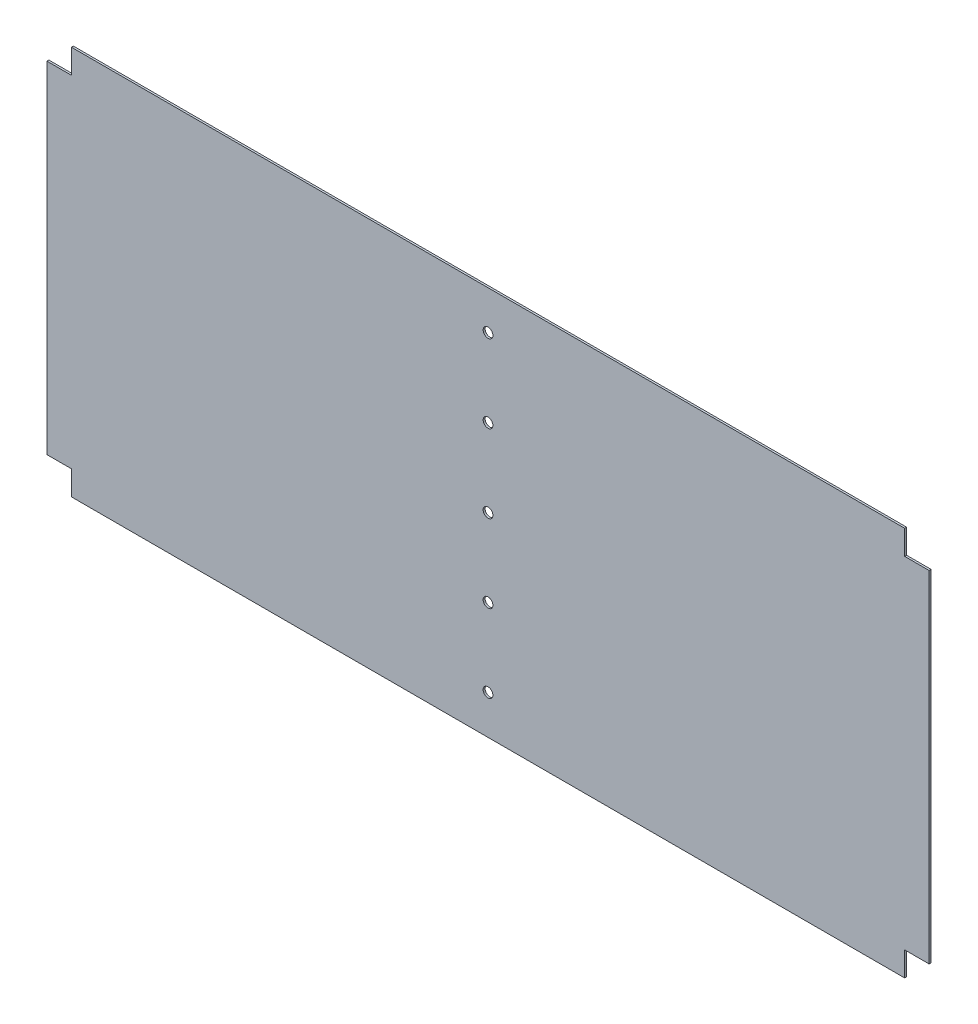
ISO-10303-21;
HEADER;
FILE_DESCRIPTION(('STEP AP214'),'2;1');
FILE_NAME('part.step','',(''),(''),'','','');
FILE_SCHEMA(('AUTOMOTIVE_DESIGN { 1 0 10303 214 1 1 1 1 }'));
ENDSEC;
DATA;
#1=APPLICATION_CONTEXT('core data for automotive mechanical design processes');
#2=APPLICATION_PROTOCOL_DEFINITION('international standard','automotive_design',2000,#1);
#3=PRODUCT_CONTEXT('',#1,'mechanical');
#4=PRODUCT('Part','Part','',(#3));
#5=PRODUCT_RELATED_PRODUCT_CATEGORY('part','',(#4));
#6=PRODUCT_DEFINITION_FORMATION('','',#4);
#7=PRODUCT_DEFINITION_CONTEXT('part definition',#1,'design');
#8=PRODUCT_DEFINITION('design','',#6,#7);
#9=PRODUCT_DEFINITION_SHAPE('','',#8);
#10=(LENGTH_UNIT() NAMED_UNIT(*) SI_UNIT(.MILLI.,.METRE.));
#11=(NAMED_UNIT(*) PLANE_ANGLE_UNIT() SI_UNIT($,.RADIAN.));
#12=(NAMED_UNIT(*) SI_UNIT($,.STERADIAN.) SOLID_ANGLE_UNIT());
#13=UNCERTAINTY_MEASURE_WITH_UNIT(LENGTH_MEASURE(1.E-05),#10,'distance_accuracy_value','');
#14=(GEOMETRIC_REPRESENTATION_CONTEXT(3) GLOBAL_UNCERTAINTY_ASSIGNED_CONTEXT((#13)) GLOBAL_UNIT_ASSIGNED_CONTEXT((#10,
#11,#12)) REPRESENTATION_CONTEXT('',''));
#15=CARTESIAN_POINT('',(0.,0.,0.));
#16=DIRECTION('',(0.,0.,1.));
#17=DIRECTION('',(1.,0.,0.));
#18=AXIS2_PLACEMENT_3D('',#15,#16,#17);
#19=CARTESIAN_POINT('',(-453.,400.,-2.));
#20=DIRECTION('',(-1.,0.,0.));
#21=DIRECTION('',(0.,0.,1.));
#22=AXIS2_PLACEMENT_3D('',#19,#20,#21);
#23=PLANE('',#22);
#24=DIRECTION('',(0.,0.,1.));
#25=VECTOR('',#24,1.);
#26=CARTESIAN_POINT('',(-453.,25.,-10.));
#27=LINE('',#26,#25);
#28=CARTESIAN_POINT('',(-453.,25.,-2.));
#29=VERTEX_POINT('',#28);
#30=CARTESIAN_POINT('',(-453.,25.,0.));
#31=VERTEX_POINT('',#30);
#32=EDGE_CURVE('E158',#29,#31,#27,.T.);
#33=ORIENTED_EDGE('',*,*,#32,.T.);
#34=DIRECTION('',(0.,-1.,0.));
#35=VECTOR('',#34,1.);
#36=CARTESIAN_POINT('',(-453.,400.,0.));
#37=LINE('',#36,#35);
#38=CARTESIAN_POINT('',(-453.,375.,0.));
#39=VERTEX_POINT('',#38);
#40=EDGE_CURVE('E209',#39,#31,#37,.T.);
#41=ORIENTED_EDGE('',*,*,#40,.F.);
#42=DIRECTION('',(0.,0.,1.));
#43=VECTOR('',#42,1.);
#44=CARTESIAN_POINT('',(-453.,375.,-10.));
#45=LINE('',#44,#43);
#46=CARTESIAN_POINT('',(-453.,375.,-2.));
#47=VERTEX_POINT('',#46);
#48=EDGE_CURVE('E181',#47,#39,#45,.T.);
#49=ORIENTED_EDGE('',*,*,#48,.F.);
#50=DIRECTION('',(0.,-1.,0.));
#51=VECTOR('',#50,1.);
#52=CARTESIAN_POINT('',(-453.,400.,-2.));
#53=LINE('',#52,#51);
#54=EDGE_CURVE('E210',#47,#29,#53,.T.);
#55=ORIENTED_EDGE('',*,*,#54,.T.);
#56=EDGE_LOOP('',(#33,#41,#49,#55));
#57=FACE_BOUND('',#56,.T.);
#58=ADVANCED_FACE('F36',(#57),#23,.T.);
#59=CARTESIAN_POINT('',(-453.,400.,-2.));
#60=DIRECTION('',(0.,1.,0.));
#61=DIRECTION('',(-1.,0.,0.));
#62=AXIS2_PLACEMENT_3D('',#59,#60,#61);
#63=PLANE('',#62);
#64=DIRECTION('',(0.,0.,1.));
#65=VECTOR('',#64,1.);
#66=CARTESIAN_POINT('',(428.,400.,-10.));
#67=LINE('',#66,#65);
#68=CARTESIAN_POINT('',(428.,400.,-2.));
#69=VERTEX_POINT('',#68);
#70=CARTESIAN_POINT('',(428.,400.,0.));
#71=VERTEX_POINT('',#70);
#72=EDGE_CURVE('E52',#69,#71,#67,.T.);
#73=ORIENTED_EDGE('',*,*,#72,.F.);
#74=DIRECTION('',(-1.,0.,0.));
#75=VECTOR('',#74,1.);
#76=CARTESIAN_POINT('',(-453.,400.,-2.));
#77=LINE('',#76,#75);
#78=CARTESIAN_POINT('',(-428.,400.,-2.));
#79=VERTEX_POINT('',#78);
#80=EDGE_CURVE('E11',#69,#79,#77,.T.);
#81=ORIENTED_EDGE('',*,*,#80,.T.);
#82=DIRECTION('',(0.,0.,1.));
#83=VECTOR('',#82,1.);
#84=CARTESIAN_POINT('',(-428.,400.,-10.));
#85=LINE('',#84,#83);
#86=CARTESIAN_POINT('',(-428.,400.,0.));
#87=VERTEX_POINT('',#86);
#88=EDGE_CURVE('E182',#79,#87,#85,.T.);
#89=ORIENTED_EDGE('',*,*,#88,.T.);
#90=DIRECTION('',(-1.,0.,0.));
#91=VECTOR('',#90,1.);
#92=CARTESIAN_POINT('',(-453.,400.,0.));
#93=LINE('',#92,#91);
#94=EDGE_CURVE('E39',#71,#87,#93,.T.);
#95=ORIENTED_EDGE('',*,*,#94,.F.);
#96=EDGE_LOOP('',(#73,#81,#89,#95));
#97=FACE_BOUND('',#96,.T.);
#98=ADVANCED_FACE('F225',(#97),#63,.T.);
#99=CARTESIAN_POINT('',(453.,400.,-2.));
#100=DIRECTION('',(1.,0.,0.));
#101=DIRECTION('',(0.,1.,0.));
#102=AXIS2_PLACEMENT_3D('',#99,#100,#101);
#103=PLANE('',#102);
#104=DIRECTION('',(0.,0.,1.));
#105=VECTOR('',#104,1.);
#106=CARTESIAN_POINT('',(453.,25.,-10.));
#107=LINE('',#106,#105);
#108=CARTESIAN_POINT('',(453.,25.,-2.));
#109=VERTEX_POINT('',#108);
#110=CARTESIAN_POINT('',(453.,25.,0.));
#111=VERTEX_POINT('',#110);
#112=EDGE_CURVE('E60',#109,#111,#107,.T.);
#113=ORIENTED_EDGE('',*,*,#112,.F.);
#114=DIRECTION('',(0.,1.,0.));
#115=VECTOR('',#114,1.);
#116=CARTESIAN_POINT('',(453.,400.,-2.));
#117=LINE('',#116,#115);
#118=CARTESIAN_POINT('',(453.,375.,-2.));
#119=VERTEX_POINT('',#118);
#120=EDGE_CURVE('E44',#109,#119,#117,.T.);
#121=ORIENTED_EDGE('',*,*,#120,.T.);
#122=DIRECTION('',(0.,0.,1.));
#123=VECTOR('',#122,1.);
#124=CARTESIAN_POINT('',(453.,375.,-10.));
#125=LINE('',#124,#123);
#126=CARTESIAN_POINT('',(453.,375.,0.));
#127=VERTEX_POINT('',#126);
#128=EDGE_CURVE('E135',#119,#127,#125,.T.);
#129=ORIENTED_EDGE('',*,*,#128,.T.);
#130=DIRECTION('',(0.,1.,0.));
#131=VECTOR('',#130,1.);
#132=CARTESIAN_POINT('',(453.,400.,0.));
#133=LINE('',#132,#131);
#134=EDGE_CURVE('E148',#111,#127,#133,.T.);
#135=ORIENTED_EDGE('',*,*,#134,.F.);
#136=EDGE_LOOP('',(#113,#121,#129,#135));
#137=FACE_BOUND('',#136,.T.);
#138=ADVANCED_FACE('F256',(#137),#103,.T.);
#139=CARTESIAN_POINT('',(-453.,0.,-2.));
#140=DIRECTION('',(0.,-1.,0.));
#141=DIRECTION('',(1.,0.,0.));
#142=AXIS2_PLACEMENT_3D('',#139,#140,#141);
#143=PLANE('',#142);
#144=DIRECTION('',(0.,0.,1.));
#145=VECTOR('',#144,1.);
#146=CARTESIAN_POINT('',(-428.,2.22044604925031E-13,-10.));
#147=LINE('',#146,#145);
#148=CARTESIAN_POINT('',(-428.,2.22044604925031E-13,-2.));
#149=VERTEX_POINT('',#148);
#150=CARTESIAN_POINT('',(-428.,0.,0.));
#151=VERTEX_POINT('',#150);
#152=EDGE_CURVE('E171',#149,#151,#147,.T.);
#153=ORIENTED_EDGE('',*,*,#152,.F.);
#154=DIRECTION('',(1.,0.,0.));
#155=VECTOR('',#154,1.);
#156=CARTESIAN_POINT('',(-453.,0.,-2.));
#157=LINE('',#156,#155);
#158=CARTESIAN_POINT('',(428.,2.22044604925031E-13,-2.));
#159=VERTEX_POINT('',#158);
#160=EDGE_CURVE('E213',#149,#159,#157,.T.);
#161=ORIENTED_EDGE('',*,*,#160,.T.);
#162=DIRECTION('',(0.,0.,1.));
#163=VECTOR('',#162,1.);
#164=CARTESIAN_POINT('',(428.,2.22044604925031E-13,-10.));
#165=LINE('',#164,#163);
#166=CARTESIAN_POINT('',(428.,2.22044604925031E-13,0.));
#167=VERTEX_POINT('',#166);
#168=EDGE_CURVE('E142',#159,#167,#165,.T.);
#169=ORIENTED_EDGE('',*,*,#168,.T.);
#170=DIRECTION('',(1.,0.,0.));
#171=VECTOR('',#170,1.);
#172=CARTESIAN_POINT('',(-453.,0.,0.));
#173=LINE('',#172,#171);
#174=EDGE_CURVE('E220',#151,#167,#173,.T.);
#175=ORIENTED_EDGE('',*,*,#174,.F.);
#176=EDGE_LOOP('',(#153,#161,#169,#175));
#177=FACE_BOUND('',#176,.T.);
#178=ADVANCED_FACE('F248',(#177),#143,.T.);
#179=CARTESIAN_POINT('',(0.,0.,-2.));
#180=DIRECTION('',(0.,0.,1.));
#181=DIRECTION('',(1.,0.,0.));
#182=AXIS2_PLACEMENT_3D('',#179,#180,#181);
#183=PLANE('',#182);
#184=CARTESIAN_POINT('',(0.,360.,-2.));
#185=DIRECTION('',(0.,0.,1.));
#186=DIRECTION('',(1.,0.,0.));
#187=AXIS2_PLACEMENT_3D('',#184,#185,#186);
#188=CIRCLE('',#187,5.);
#189=CARTESIAN_POINT('',(5.,360.,-2.));
#190=VERTEX_POINT('',#189);
#191=EDGE_CURVE('E169',#190,#190,#188,.T.);
#192=ORIENTED_EDGE('',*,*,#191,.T.);
#193=EDGE_LOOP('',(#192));
#194=FACE_BOUND('',#193,.T.);
#195=CARTESIAN_POINT('',(0.,280.,-2.));
#196=DIRECTION('',(0.,0.,1.));
#197=DIRECTION('',(1.,0.,0.));
#198=AXIS2_PLACEMENT_3D('',#195,#196,#197);
#199=CIRCLE('',#198,5.);
#200=CARTESIAN_POINT('',(5.,280.,-2.));
#201=VERTEX_POINT('',#200);
#202=EDGE_CURVE('E463',#201,#201,#199,.T.);
#203=ORIENTED_EDGE('',*,*,#202,.T.);
#204=EDGE_LOOP('',(#203));
#205=FACE_BOUND('',#204,.T.);
#206=CARTESIAN_POINT('',(0.,200.,-2.));
#207=DIRECTION('',(0.,0.,1.));
#208=DIRECTION('',(1.,0.,0.));
#209=AXIS2_PLACEMENT_3D('',#206,#207,#208);
#210=CIRCLE('',#209,5.);
#211=CARTESIAN_POINT('',(5.,200.,-2.));
#212=VERTEX_POINT('',#211);
#213=EDGE_CURVE('E465',#212,#212,#210,.T.);
#214=ORIENTED_EDGE('',*,*,#213,.T.);
#215=EDGE_LOOP('',(#214));
#216=FACE_BOUND('',#215,.T.);
#217=CARTESIAN_POINT('',(0.,120.,-2.));
#218=DIRECTION('',(0.,0.,1.));
#219=DIRECTION('',(1.,0.,0.));
#220=AXIS2_PLACEMENT_3D('',#217,#218,#219);
#221=CIRCLE('',#220,5.);
#222=CARTESIAN_POINT('',(5.,120.,-2.));
#223=VERTEX_POINT('',#222);
#224=EDGE_CURVE('E470',#223,#223,#221,.T.);
#225=ORIENTED_EDGE('',*,*,#224,.T.);
#226=EDGE_LOOP('',(#225));
#227=FACE_BOUND('',#226,.T.);
#228=CARTESIAN_POINT('',(0.,40.0000000000001,-2.));
#229=DIRECTION('',(0.,0.,1.));
#230=DIRECTION('',(1.,0.,0.));
#231=AXIS2_PLACEMENT_3D('',#228,#229,#230);
#232=CIRCLE('',#231,5.);
#233=CARTESIAN_POINT('',(5.,40.0000000000001,-2.));
#234=VERTEX_POINT('',#233);
#235=EDGE_CURVE('E473',#234,#234,#232,.T.);
#236=ORIENTED_EDGE('',*,*,#235,.T.);
#237=EDGE_LOOP('',(#236));
#238=FACE_BOUND('',#237,.T.);
#239=DIRECTION('',(0.,1.,0.));
#240=VECTOR('',#239,1.);
#241=CARTESIAN_POINT('',(-428.,0.,-2.));
#242=LINE('',#241,#240);
#243=CARTESIAN_POINT('',(-428.,25.,-2.));
#244=VERTEX_POINT('',#243);
#245=EDGE_CURVE('E203',#149,#244,#242,.T.);
#246=ORIENTED_EDGE('',*,*,#245,.T.);
#247=DIRECTION('',(-1.,0.,0.));
#248=VECTOR('',#247,1.);
#249=CARTESIAN_POINT('',(0.,25.,-2.));
#250=LINE('',#249,#248);
#251=EDGE_CURVE('E206',#244,#29,#250,.T.);
#252=ORIENTED_EDGE('',*,*,#251,.T.);
#253=ORIENTED_EDGE('',*,*,#54,.F.);
#254=DIRECTION('',(1.,0.,0.));
#255=VECTOR('',#254,1.);
#256=CARTESIAN_POINT('',(0.,375.,-2.));
#257=LINE('',#256,#255);
#258=CARTESIAN_POINT('',(-428.,375.,-2.));
#259=VERTEX_POINT('',#258);
#260=EDGE_CURVE('E185',#47,#259,#257,.T.);
#261=ORIENTED_EDGE('',*,*,#260,.T.);
#262=DIRECTION('',(0.,1.,0.));
#263=VECTOR('',#262,1.);
#264=CARTESIAN_POINT('',(-428.,0.,-2.));
#265=LINE('',#264,#263);
#266=EDGE_CURVE('E191',#259,#79,#265,.T.);
#267=ORIENTED_EDGE('',*,*,#266,.T.);
#268=ORIENTED_EDGE('',*,*,#80,.F.);
#269=DIRECTION('',(0.,-1.,0.));
#270=VECTOR('',#269,1.);
#271=CARTESIAN_POINT('',(428.,0.,-2.));
#272=LINE('',#271,#270);
#273=CARTESIAN_POINT('',(428.,375.,-2.));
#274=VERTEX_POINT('',#273);
#275=EDGE_CURVE('E194',#69,#274,#272,.T.);
#276=ORIENTED_EDGE('',*,*,#275,.T.);
#277=DIRECTION('',(1.,0.,0.));
#278=VECTOR('',#277,1.);
#279=CARTESIAN_POINT('',(0.,375.,-2.));
#280=LINE('',#279,#278);
#281=EDGE_CURVE('E133',#274,#119,#280,.T.);
#282=ORIENTED_EDGE('',*,*,#281,.T.);
#283=ORIENTED_EDGE('',*,*,#120,.F.);
#284=DIRECTION('',(-1.,0.,0.));
#285=VECTOR('',#284,1.);
#286=CARTESIAN_POINT('',(0.,25.,-2.));
#287=LINE('',#286,#285);
#288=CARTESIAN_POINT('',(428.,25.,-2.));
#289=VERTEX_POINT('',#288);
#290=EDGE_CURVE('E197',#109,#289,#287,.T.);
#291=ORIENTED_EDGE('',*,*,#290,.T.);
#292=DIRECTION('',(0.,-1.,0.));
#293=VECTOR('',#292,1.);
#294=CARTESIAN_POINT('',(428.,0.,-2.));
#295=LINE('',#294,#293);
#296=EDGE_CURVE('E200',#289,#159,#295,.T.);
#297=ORIENTED_EDGE('',*,*,#296,.T.);
#298=ORIENTED_EDGE('',*,*,#160,.F.);
#299=EDGE_LOOP('',(#246,#252,#253,#261,#267,#268,#276,#282,#283,#291,#297,#298));
#300=FACE_BOUND('',#299,.T.);
#301=ADVANCED_FACE('F231',(#194,#205,#216,#227,#238,#300),#183,.F.);
#302=CARTESIAN_POINT('',(0.,0.,0.));
#303=DIRECTION('',(0.,0.,1.));
#304=DIRECTION('',(1.,0.,0.));
#305=AXIS2_PLACEMENT_3D('',#302,#303,#304);
#306=PLANE('',#305);
#307=CARTESIAN_POINT('',(0.,360.,0.));
#308=DIRECTION('',(0.,0.,1.));
#309=DIRECTION('',(1.,0.,0.));
#310=AXIS2_PLACEMENT_3D('',#307,#308,#309);
#311=CIRCLE('',#310,5.);
#312=CARTESIAN_POINT('',(5.,360.,0.));
#313=VERTEX_POINT('',#312);
#314=EDGE_CURVE('E460',#313,#313,#311,.T.);
#315=ORIENTED_EDGE('',*,*,#314,.F.);
#316=EDGE_LOOP('',(#315));
#317=FACE_BOUND('',#316,.T.);
#318=CARTESIAN_POINT('',(0.,280.,0.));
#319=DIRECTION('',(0.,0.,1.));
#320=DIRECTION('',(1.,0.,0.));
#321=AXIS2_PLACEMENT_3D('',#318,#319,#320);
#322=CIRCLE('',#321,5.);
#323=CARTESIAN_POINT('',(5.,280.,0.));
#324=VERTEX_POINT('',#323);
#325=EDGE_CURVE('E485',#324,#324,#322,.T.);
#326=ORIENTED_EDGE('',*,*,#325,.F.);
#327=EDGE_LOOP('',(#326));
#328=FACE_BOUND('',#327,.T.);
#329=CARTESIAN_POINT('',(0.,200.,0.));
#330=DIRECTION('',(0.,0.,1.));
#331=DIRECTION('',(1.,0.,0.));
#332=AXIS2_PLACEMENT_3D('',#329,#330,#331);
#333=CIRCLE('',#332,5.);
#334=CARTESIAN_POINT('',(5.,200.,0.));
#335=VERTEX_POINT('',#334);
#336=EDGE_CURVE('E482',#335,#335,#333,.T.);
#337=ORIENTED_EDGE('',*,*,#336,.F.);
#338=EDGE_LOOP('',(#337));
#339=FACE_BOUND('',#338,.T.);
#340=CARTESIAN_POINT('',(0.,120.,0.));
#341=DIRECTION('',(0.,0.,1.));
#342=DIRECTION('',(1.,0.,0.));
#343=AXIS2_PLACEMENT_3D('',#340,#341,#342);
#344=CIRCLE('',#343,5.);
#345=CARTESIAN_POINT('',(5.,120.,0.));
#346=VERTEX_POINT('',#345);
#347=EDGE_CURVE('E479',#346,#346,#344,.T.);
#348=ORIENTED_EDGE('',*,*,#347,.F.);
#349=EDGE_LOOP('',(#348));
#350=FACE_BOUND('',#349,.T.);
#351=CARTESIAN_POINT('',(0.,40.0000000000001,0.));
#352=DIRECTION('',(0.,0.,1.));
#353=DIRECTION('',(1.,0.,0.));
#354=AXIS2_PLACEMENT_3D('',#351,#352,#353);
#355=CIRCLE('',#354,5.);
#356=CARTESIAN_POINT('',(5.,40.0000000000001,0.));
#357=VERTEX_POINT('',#356);
#358=EDGE_CURVE('E476',#357,#357,#355,.T.);
#359=ORIENTED_EDGE('',*,*,#358,.F.);
#360=EDGE_LOOP('',(#359));
#361=FACE_BOUND('',#360,.T.);
#362=DIRECTION('',(-1.,0.,0.));
#363=VECTOR('',#362,1.);
#364=CARTESIAN_POINT('',(-453.,25.,0.));
#365=LINE('',#364,#363);
#366=CARTESIAN_POINT('',(-428.,25.,0.));
#367=VERTEX_POINT('',#366);
#368=EDGE_CURVE('E168',#367,#31,#365,.T.);
#369=ORIENTED_EDGE('',*,*,#368,.F.);
#370=DIRECTION('',(0.,1.,0.));
#371=VECTOR('',#370,1.);
#372=CARTESIAN_POINT('',(-428.,2.22044604925031E-13,0.));
#373=LINE('',#372,#371);
#374=EDGE_CURVE('E165',#151,#367,#373,.T.);
#375=ORIENTED_EDGE('',*,*,#374,.F.);
#376=ORIENTED_EDGE('',*,*,#174,.T.);
#377=DIRECTION('',(0.,-1.,0.));
#378=VECTOR('',#377,1.);
#379=CARTESIAN_POINT('',(428.,2.22044604925031E-13,0.));
#380=LINE('',#379,#378);
#381=CARTESIAN_POINT('',(428.,25.,0.));
#382=VERTEX_POINT('',#381);
#383=EDGE_CURVE('E157',#382,#167,#380,.T.);
#384=ORIENTED_EDGE('',*,*,#383,.F.);
#385=DIRECTION('',(-1.,0.,0.));
#386=VECTOR('',#385,1.);
#387=CARTESIAN_POINT('',(453.,25.,0.));
#388=LINE('',#387,#386);
#389=EDGE_CURVE('E155',#111,#382,#388,.T.);
#390=ORIENTED_EDGE('',*,*,#389,.F.);
#391=ORIENTED_EDGE('',*,*,#134,.T.);
#392=DIRECTION('',(1.,0.,0.));
#393=VECTOR('',#392,1.);
#394=CARTESIAN_POINT('',(453.,375.,0.));
#395=LINE('',#394,#393);
#396=CARTESIAN_POINT('',(428.,375.,0.));
#397=VERTEX_POINT('',#396);
#398=EDGE_CURVE('E130',#397,#127,#395,.T.);
#399=ORIENTED_EDGE('',*,*,#398,.F.);
#400=DIRECTION('',(0.,-1.,0.));
#401=VECTOR('',#400,1.);
#402=CARTESIAN_POINT('',(428.,400.,0.));
#403=LINE('',#402,#401);
#404=EDGE_CURVE('E137',#71,#397,#403,.T.);
#405=ORIENTED_EDGE('',*,*,#404,.F.);
#406=ORIENTED_EDGE('',*,*,#94,.T.);
#407=DIRECTION('',(0.,1.,0.));
#408=VECTOR('',#407,1.);
#409=CARTESIAN_POINT('',(-428.,400.,0.));
#410=LINE('',#409,#408);
#411=CARTESIAN_POINT('',(-428.,375.,0.));
#412=VERTEX_POINT('',#411);
#413=EDGE_CURVE('E179',#412,#87,#410,.T.);
#414=ORIENTED_EDGE('',*,*,#413,.F.);
#415=DIRECTION('',(1.,0.,0.));
#416=VECTOR('',#415,1.);
#417=CARTESIAN_POINT('',(-453.,375.,0.));
#418=LINE('',#417,#416);
#419=EDGE_CURVE('E153',#39,#412,#418,.T.);
#420=ORIENTED_EDGE('',*,*,#419,.F.);
#421=ORIENTED_EDGE('',*,*,#40,.T.);
#422=EDGE_LOOP('',(#369,#375,#376,#384,#390,#391,#399,#405,#406,#414,#420,#421));
#423=FACE_BOUND('',#422,.T.);
#424=ADVANCED_FACE('F146',(#317,#328,#339,#350,#361,#423),#306,.T.);
#425=CARTESIAN_POINT('',(-428.,400.,-10.));
#426=DIRECTION('',(1.,0.,0.));
#427=DIRECTION('',(0.,0.,-1.));
#428=AXIS2_PLACEMENT_3D('',#425,#426,#427);
#429=PLANE('',#428);
#430=DIRECTION('',(0.,0.,1.));
#431=VECTOR('',#430,1.);
#432=CARTESIAN_POINT('',(-428.,375.,-10.));
#433=LINE('',#432,#431);
#434=EDGE_CURVE('E186',#259,#412,#433,.T.);
#435=ORIENTED_EDGE('',*,*,#434,.T.);
#436=ORIENTED_EDGE('',*,*,#413,.T.);
#437=ORIENTED_EDGE('',*,*,#88,.F.);
#438=ORIENTED_EDGE('',*,*,#266,.F.);
#439=EDGE_LOOP('',(#435,#436,#437,#438));
#440=FACE_BOUND('',#439,.T.);
#441=ADVANCED_FACE('F228',(#440),#429,.F.);
#442=CARTESIAN_POINT('',(-453.,375.,-10.));
#443=DIRECTION('',(0.,-1.,0.));
#444=DIRECTION('',(0.,0.,-1.));
#445=AXIS2_PLACEMENT_3D('',#442,#443,#444);
#446=PLANE('',#445);
#447=ORIENTED_EDGE('',*,*,#48,.T.);
#448=ORIENTED_EDGE('',*,*,#419,.T.);
#449=ORIENTED_EDGE('',*,*,#434,.F.);
#450=ORIENTED_EDGE('',*,*,#260,.F.);
#451=EDGE_LOOP('',(#447,#448,#449,#450));
#452=FACE_BOUND('',#451,.T.);
#453=ADVANCED_FACE('F235',(#452),#446,.F.);
#454=CARTESIAN_POINT('',(453.,375.,-10.));
#455=DIRECTION('',(0.,-1.,0.));
#456=DIRECTION('',(0.,0.,-1.));
#457=AXIS2_PLACEMENT_3D('',#454,#455,#456);
#458=PLANE('',#457);
#459=DIRECTION('',(0.,0.,1.));
#460=VECTOR('',#459,1.);
#461=CARTESIAN_POINT('',(428.,375.,-10.));
#462=LINE('',#461,#460);
#463=EDGE_CURVE('E127',#274,#397,#462,.T.);
#464=ORIENTED_EDGE('',*,*,#463,.T.);
#465=ORIENTED_EDGE('',*,*,#398,.T.);
#466=ORIENTED_EDGE('',*,*,#128,.F.);
#467=ORIENTED_EDGE('',*,*,#281,.F.);
#468=EDGE_LOOP('',(#464,#465,#466,#467));
#469=FACE_BOUND('',#468,.T.);
#470=ADVANCED_FACE('F128',(#469),#458,.F.);
#471=CARTESIAN_POINT('',(428.,400.,-10.));
#472=DIRECTION('',(-1.,0.,0.));
#473=DIRECTION('',(0.,0.,1.));
#474=AXIS2_PLACEMENT_3D('',#471,#472,#473);
#475=PLANE('',#474);
#476=ORIENTED_EDGE('',*,*,#72,.T.);
#477=ORIENTED_EDGE('',*,*,#404,.T.);
#478=ORIENTED_EDGE('',*,*,#463,.F.);
#479=ORIENTED_EDGE('',*,*,#275,.F.);
#480=EDGE_LOOP('',(#476,#477,#478,#479));
#481=FACE_BOUND('',#480,.T.);
#482=ADVANCED_FACE('F138',(#481),#475,.F.);
#483=CARTESIAN_POINT('',(428.,2.22044604925031E-13,-10.));
#484=DIRECTION('',(-1.,0.,0.));
#485=DIRECTION('',(0.,0.,1.));
#486=AXIS2_PLACEMENT_3D('',#483,#484,#485);
#487=PLANE('',#486);
#488=DIRECTION('',(0.,0.,1.));
#489=VECTOR('',#488,1.);
#490=CARTESIAN_POINT('',(428.,25.,-10.));
#491=LINE('',#490,#489);
#492=EDGE_CURVE('E162',#289,#382,#491,.T.);
#493=ORIENTED_EDGE('',*,*,#492,.T.);
#494=ORIENTED_EDGE('',*,*,#383,.T.);
#495=ORIENTED_EDGE('',*,*,#168,.F.);
#496=ORIENTED_EDGE('',*,*,#296,.F.);
#497=EDGE_LOOP('',(#493,#494,#495,#496));
#498=FACE_BOUND('',#497,.T.);
#499=ADVANCED_FACE('F252',(#498),#487,.F.);
#500=CARTESIAN_POINT('',(453.,25.,-10.));
#501=DIRECTION('',(0.,1.,0.));
#502=DIRECTION('',(0.,0.,1.));
#503=AXIS2_PLACEMENT_3D('',#500,#501,#502);
#504=PLANE('',#503);
#505=ORIENTED_EDGE('',*,*,#112,.T.);
#506=ORIENTED_EDGE('',*,*,#389,.T.);
#507=ORIENTED_EDGE('',*,*,#492,.F.);
#508=ORIENTED_EDGE('',*,*,#290,.F.);
#509=EDGE_LOOP('',(#505,#506,#507,#508));
#510=FACE_BOUND('',#509,.T.);
#511=ADVANCED_FACE('F253',(#510),#504,.F.);
#512=CARTESIAN_POINT('',(-453.,25.,-10.));
#513=DIRECTION('',(0.,1.,0.));
#514=DIRECTION('',(0.,0.,1.));
#515=AXIS2_PLACEMENT_3D('',#512,#513,#514);
#516=PLANE('',#515);
#517=DIRECTION('',(0.,0.,1.));
#518=VECTOR('',#517,1.);
#519=CARTESIAN_POINT('',(-428.,25.,-10.));
#520=LINE('',#519,#518);
#521=EDGE_CURVE('E174',#244,#367,#520,.T.);
#522=ORIENTED_EDGE('',*,*,#521,.T.);
#523=ORIENTED_EDGE('',*,*,#368,.T.);
#524=ORIENTED_EDGE('',*,*,#32,.F.);
#525=ORIENTED_EDGE('',*,*,#251,.F.);
#526=EDGE_LOOP('',(#522,#523,#524,#525));
#527=FACE_BOUND('',#526,.T.);
#528=ADVANCED_FACE('F241',(#527),#516,.F.);
#529=CARTESIAN_POINT('',(-428.,2.22044604925031E-13,-10.));
#530=DIRECTION('',(1.,0.,0.));
#531=DIRECTION('',(0.,0.,-1.));
#532=AXIS2_PLACEMENT_3D('',#529,#530,#531);
#533=PLANE('',#532);
#534=ORIENTED_EDGE('',*,*,#152,.T.);
#535=ORIENTED_EDGE('',*,*,#374,.T.);
#536=ORIENTED_EDGE('',*,*,#521,.F.);
#537=ORIENTED_EDGE('',*,*,#245,.F.);
#538=EDGE_LOOP('',(#534,#535,#536,#537));
#539=FACE_BOUND('',#538,.T.);
#540=ADVANCED_FACE('F244',(#539),#533,.F.);
#541=CARTESIAN_POINT('',(0.,40.0000000000001,-10.));
#542=DIRECTION('',(0.,0.,1.));
#543=DIRECTION('',(1.,0.,0.));
#544=AXIS2_PLACEMENT_3D('',#541,#542,#543);
#545=CYLINDRICAL_SURFACE('',#544,5.);
#546=ORIENTED_EDGE('',*,*,#358,.T.);
#547=EDGE_LOOP('',(#546));
#548=FACE_BOUND('',#547,.T.);
#549=ORIENTED_EDGE('',*,*,#235,.F.);
#550=EDGE_LOOP('',(#549));
#551=FACE_BOUND('',#550,.T.);
#552=ADVANCED_FACE('F360',(#548,#551),#545,.F.);
#553=CARTESIAN_POINT('',(0.,120.,-10.));
#554=DIRECTION('',(0.,0.,1.));
#555=DIRECTION('',(1.,0.,0.));
#556=AXIS2_PLACEMENT_3D('',#553,#554,#555);
#557=CYLINDRICAL_SURFACE('',#556,5.);
#558=ORIENTED_EDGE('',*,*,#347,.T.);
#559=EDGE_LOOP('',(#558));
#560=FACE_BOUND('',#559,.T.);
#561=ORIENTED_EDGE('',*,*,#224,.F.);
#562=EDGE_LOOP('',(#561));
#563=FACE_BOUND('',#562,.T.);
#564=ADVANCED_FACE('F386',(#560,#563),#557,.F.);
#565=CARTESIAN_POINT('',(0.,200.,-10.));
#566=DIRECTION('',(0.,0.,1.));
#567=DIRECTION('',(1.,0.,0.));
#568=AXIS2_PLACEMENT_3D('',#565,#566,#567);
#569=CYLINDRICAL_SURFACE('',#568,5.);
#570=ORIENTED_EDGE('',*,*,#336,.T.);
#571=EDGE_LOOP('',(#570));
#572=FACE_BOUND('',#571,.T.);
#573=ORIENTED_EDGE('',*,*,#213,.F.);
#574=EDGE_LOOP('',(#573));
#575=FACE_BOUND('',#574,.T.);
#576=ADVANCED_FACE('F397',(#572,#575),#569,.F.);
#577=CARTESIAN_POINT('',(0.,280.,-10.));
#578=DIRECTION('',(0.,0.,1.));
#579=DIRECTION('',(1.,0.,0.));
#580=AXIS2_PLACEMENT_3D('',#577,#578,#579);
#581=CYLINDRICAL_SURFACE('',#580,5.);
#582=ORIENTED_EDGE('',*,*,#325,.T.);
#583=EDGE_LOOP('',(#582));
#584=FACE_BOUND('',#583,.T.);
#585=ORIENTED_EDGE('',*,*,#202,.F.);
#586=EDGE_LOOP('',(#585));
#587=FACE_BOUND('',#586,.T.);
#588=ADVANCED_FACE('F408',(#584,#587),#581,.F.);
#589=CARTESIAN_POINT('',(0.,360.,-10.));
#590=DIRECTION('',(0.,0.,1.));
#591=DIRECTION('',(1.,0.,0.));
#592=AXIS2_PLACEMENT_3D('',#589,#590,#591);
#593=CYLINDRICAL_SURFACE('',#592,5.);
#594=ORIENTED_EDGE('',*,*,#314,.T.);
#595=EDGE_LOOP('',(#594));
#596=FACE_BOUND('',#595,.T.);
#597=ORIENTED_EDGE('',*,*,#191,.F.);
#598=EDGE_LOOP('',(#597));
#599=FACE_BOUND('',#598,.T.);
#600=ADVANCED_FACE('F419',(#596,#599),#593,.F.);
#601=CLOSED_SHELL('',(#58,#98,#138,#178,#301,#424,#441,#453,#470,#482,#499,#511,#528,#540,#552,
#564,#576,#588,#600));
#602=MANIFOLD_SOLID_BREP('B2',#601);
#603=ADVANCED_BREP_SHAPE_REPRESENTATION('',(#18,#602),#14);
#604=SHAPE_DEFINITION_REPRESENTATION(#9,#603);
ENDSEC;
END-ISO-10303-21;
